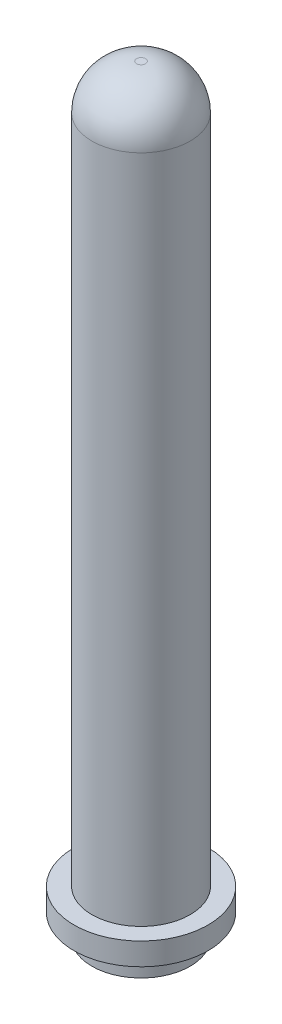
ISO-10303-21;
HEADER;
FILE_DESCRIPTION(('STEP AP214'),'2;1');
FILE_NAME('part.step','',(''),(''),'','','');
FILE_SCHEMA(('AUTOMOTIVE_DESIGN { 1 0 10303 214 1 1 1 1 }'));
ENDSEC;
DATA;
#1=APPLICATION_CONTEXT('core data for automotive mechanical design processes');
#2=APPLICATION_PROTOCOL_DEFINITION('international standard','automotive_design',2000,#1);
#3=PRODUCT_CONTEXT('',#1,'mechanical');
#4=PRODUCT('Part','Part','',(#3));
#5=PRODUCT_RELATED_PRODUCT_CATEGORY('part','',(#4));
#6=PRODUCT_DEFINITION_FORMATION('','',#4);
#7=PRODUCT_DEFINITION_CONTEXT('part definition',#1,'design');
#8=PRODUCT_DEFINITION('design','',#6,#7);
#9=PRODUCT_DEFINITION_SHAPE('','',#8);
#10=(LENGTH_UNIT() NAMED_UNIT(*) SI_UNIT(.MILLI.,.METRE.));
#11=(NAMED_UNIT(*) PLANE_ANGLE_UNIT() SI_UNIT($,.RADIAN.));
#12=(NAMED_UNIT(*) SI_UNIT($,.STERADIAN.) SOLID_ANGLE_UNIT());
#13=UNCERTAINTY_MEASURE_WITH_UNIT(LENGTH_MEASURE(1.E-05),#10,'distance_accuracy_value','');
#14=(GEOMETRIC_REPRESENTATION_CONTEXT(3) GLOBAL_UNCERTAINTY_ASSIGNED_CONTEXT((#13)) GLOBAL_UNIT_ASSIGNED_CONTEXT((#10,
#11,#12)) REPRESENTATION_CONTEXT('',''));
#15=CARTESIAN_POINT('',(0.,0.,0.));
#16=DIRECTION('',(0.,0.,1.));
#17=DIRECTION('',(1.,0.,0.));
#18=AXIS2_PLACEMENT_3D('',#15,#16,#17);
#19=CARTESIAN_POINT('',(-62.,70.,0.));
#20=DIRECTION('',(0.,1.,0.));
#21=DIRECTION('',(0.,0.,1.));
#22=AXIS2_PLACEMENT_3D('',#19,#20,#21);
#23=CYLINDRICAL_SURFACE('',#22,11.);
#24=CARTESIAN_POINT('',(-62.,230.,0.));
#25=DIRECTION('',(0.,1.,0.));
#26=DIRECTION('',(0.,0.,1.));
#27=AXIS2_PLACEMENT_3D('',#24,#25,#26);
#28=CIRCLE('',#27,11.);
#29=CARTESIAN_POINT('',(-62.,230.,11.));
#30=VERTEX_POINT('',#29);
#31=EDGE_CURVE('E10',#30,#30,#28,.F.);
#32=ORIENTED_EDGE('',*,*,#31,.T.);
#33=EDGE_LOOP('',(#32));
#34=FACE_BOUND('',#33,.T.);
#35=CARTESIAN_POINT('',(-62.,80.,0.));
#36=DIRECTION('',(0.,-1.,0.));
#37=DIRECTION('',(0.,0.,-1.));
#38=AXIS2_PLACEMENT_3D('',#35,#36,#37);
#39=CIRCLE('',#38,11.);
#40=CARTESIAN_POINT('',(-62.,80.,-11.));
#41=VERTEX_POINT('',#40);
#42=EDGE_CURVE('E63',#41,#41,#39,.F.);
#43=ORIENTED_EDGE('',*,*,#42,.T.);
#44=EDGE_LOOP('',(#43));
#45=FACE_BOUND('',#44,.T.);
#46=ADVANCED_FACE('F42',(#34,#45),#23,.T.);
#47=CARTESIAN_POINT('',(-62.,240.,0.));
#48=DIRECTION('',(0.,1.,0.));
#49=DIRECTION('',(0.,0.,1.));
#50=AXIS2_PLACEMENT_3D('',#47,#48,#49);
#51=PLANE('',#50);
#52=CARTESIAN_POINT('',(-62.,240.,0.));
#53=DIRECTION('',(0.,1.,0.));
#54=DIRECTION('',(0.,0.,1.));
#55=AXIS2_PLACEMENT_3D('',#52,#53,#54);
#56=CIRCLE('',#55,0.999999999999984);
#57=CARTESIAN_POINT('',(-62.,240.,0.999999999999984));
#58=VERTEX_POINT('',#57);
#59=EDGE_CURVE('E50',#58,#58,#56,.T.);
#60=ORIENTED_EDGE('',*,*,#59,.T.);
#61=EDGE_LOOP('',(#60));
#62=FACE_BOUND('',#61,.T.);
#63=ADVANCED_FACE('F95',(#62),#51,.T.);
#64=CARTESIAN_POINT('',(-62.,80.,0.));
#65=DIRECTION('',(0.,-1.,0.));
#66=DIRECTION('',(0.,0.,-1.));
#67=AXIS2_PLACEMENT_3D('',#64,#65,#66);
#68=CYLINDRICAL_SURFACE('',#67,15.);
#69=CARTESIAN_POINT('',(-62.,80.,0.));
#70=DIRECTION('',(0.,-1.,0.));
#71=DIRECTION('',(0.,0.,-1.));
#72=AXIS2_PLACEMENT_3D('',#69,#70,#71);
#73=CIRCLE('',#72,15.);
#74=CARTESIAN_POINT('',(-62.,80.,-15.));
#75=VERTEX_POINT('',#74);
#76=EDGE_CURVE('E66',#75,#75,#73,.T.);
#77=ORIENTED_EDGE('',*,*,#76,.T.);
#78=EDGE_LOOP('',(#77));
#79=FACE_BOUND('',#78,.T.);
#80=CARTESIAN_POINT('',(-62.,75.,0.));
#81=DIRECTION('',(0.,-1.,0.));
#82=DIRECTION('',(0.,0.,-1.));
#83=AXIS2_PLACEMENT_3D('',#80,#81,#82);
#84=CIRCLE('',#83,15.);
#85=CARTESIAN_POINT('',(-62.,75.,-15.));
#86=VERTEX_POINT('',#85);
#87=EDGE_CURVE('E71',#86,#86,#84,.T.);
#88=ORIENTED_EDGE('',*,*,#87,.F.);
#89=EDGE_LOOP('',(#88));
#90=FACE_BOUND('',#89,.T.);
#91=ADVANCED_FACE('F79',(#79,#90),#68,.T.);
#92=CARTESIAN_POINT('',(-62.,80.,0.));
#93=DIRECTION('',(0.,-1.,0.));
#94=DIRECTION('',(0.,0.,-1.));
#95=AXIS2_PLACEMENT_3D('',#92,#93,#94);
#96=PLANE('',#95);
#97=ORIENTED_EDGE('',*,*,#42,.F.);
#98=EDGE_LOOP('',(#97));
#99=FACE_BOUND('',#98,.T.);
#100=ORIENTED_EDGE('',*,*,#76,.F.);
#101=EDGE_LOOP('',(#100));
#102=FACE_BOUND('',#101,.T.);
#103=ADVANCED_FACE('F82',(#99,#102),#96,.F.);
#104=CARTESIAN_POINT('',(-62.,75.,0.));
#105=DIRECTION('',(0.,-1.,0.));
#106=DIRECTION('',(0.,0.,-1.));
#107=AXIS2_PLACEMENT_3D('',#104,#105,#106);
#108=PLANE('',#107);
#109=CARTESIAN_POINT('',(-62.,75.,0.));
#110=DIRECTION('',(0.,-1.,0.));
#111=DIRECTION('',(0.,0.,-1.));
#112=AXIS2_PLACEMENT_3D('',#109,#110,#111);
#113=CIRCLE('',#112,11.);
#114=CARTESIAN_POINT('',(-62.,75.,-11.));
#115=VERTEX_POINT('',#114);
#116=EDGE_CURVE('E55',#115,#115,#113,.F.);
#117=ORIENTED_EDGE('',*,*,#116,.T.);
#118=EDGE_LOOP('',(#117));
#119=FACE_BOUND('',#118,.T.);
#120=ORIENTED_EDGE('',*,*,#87,.T.);
#121=EDGE_LOOP('',(#120));
#122=FACE_BOUND('',#121,.T.);
#123=ADVANCED_FACE('F84',(#119,#122),#108,.T.);
#124=CARTESIAN_POINT('',(-62.,70.,0.));
#125=DIRECTION('',(0.,1.,0.));
#126=DIRECTION('',(0.,0.,1.));
#127=AXIS2_PLACEMENT_3D('',#124,#125,#126);
#128=PLANE('',#127);
#129=CARTESIAN_POINT('',(-62.,70.,0.));
#130=DIRECTION('',(0.,1.,0.));
#131=DIRECTION('',(0.,0.,1.));
#132=AXIS2_PLACEMENT_3D('',#129,#130,#131);
#133=CIRCLE('',#132,11.);
#134=CARTESIAN_POINT('',(-62.,70.,11.));
#135=VERTEX_POINT('',#134);
#136=EDGE_CURVE('E60',#135,#135,#133,.T.);
#137=ORIENTED_EDGE('',*,*,#136,.F.);
#138=EDGE_LOOP('',(#137));
#139=FACE_BOUND('',#138,.T.);
#140=ADVANCED_FACE('F92',(#139),#128,.F.);
#141=ORIENTED_EDGE('',*,*,#116,.F.);
#142=EDGE_LOOP('',(#141));
#143=FACE_BOUND('',#142,.T.);
#144=ORIENTED_EDGE('',*,*,#136,.T.);
#145=EDGE_LOOP('',(#144));
#146=FACE_BOUND('',#145,.T.);
#147=ADVANCED_FACE('F99',(#143,#146),#23,.T.);
#148=CARTESIAN_POINT('',(-62.,230.,0.));
#149=DIRECTION('',(0.,1.,0.));
#150=DIRECTION('',(0.,0.,1.));
#151=AXIS2_PLACEMENT_3D('',#148,#149,#150);
#152=DEGENERATE_TOROIDAL_SURFACE('',#151,0.999999999999984,10.,.T.);
#153=ORIENTED_EDGE('',*,*,#31,.F.);
#154=EDGE_LOOP('',(#153));
#155=FACE_BOUND('',#154,.T.);
#156=ORIENTED_EDGE('',*,*,#59,.F.);
#157=EDGE_LOOP('',(#156));
#158=FACE_BOUND('',#157,.T.);
#159=ADVANCED_FACE('F44',(#155,#158),#152,.T.);
#160=CLOSED_SHELL('',(#46,#63,#91,#103,#123,#140,#147,#159));
#161=MANIFOLD_SOLID_BREP('B2',#160);
#162=ADVANCED_BREP_SHAPE_REPRESENTATION('',(#18,#161),#14);
#163=SHAPE_DEFINITION_REPRESENTATION(#9,#162);
ENDSEC;
END-ISO-10303-21;
